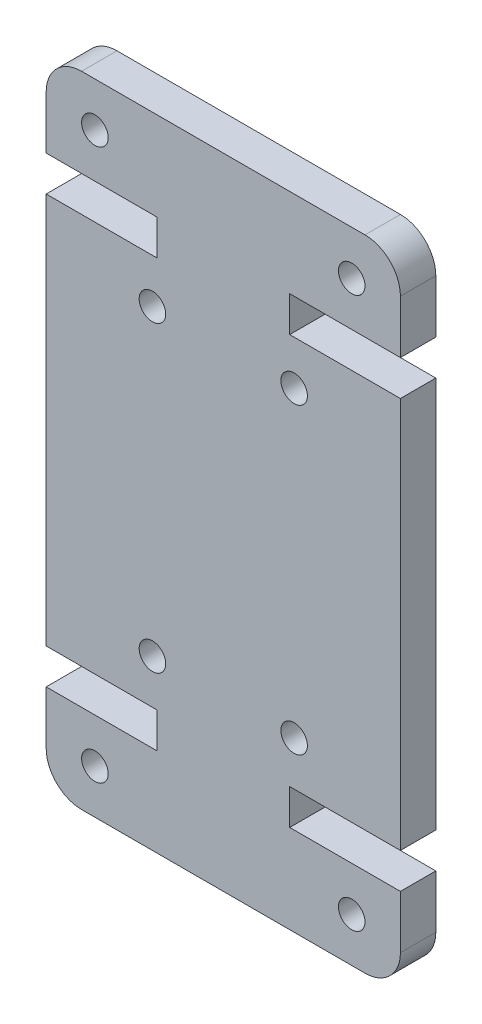
ISO-10303-21;
HEADER;
FILE_DESCRIPTION(('STEP AP214'),'2;1');
FILE_NAME('part.step','',(''),(''),'','','');
FILE_SCHEMA(('AUTOMOTIVE_DESIGN { 1 0 10303 214 1 1 1 1 }'));
ENDSEC;
DATA;
#1=APPLICATION_CONTEXT('core data for automotive mechanical design processes');
#2=APPLICATION_PROTOCOL_DEFINITION('international standard','automotive_design',2000,#1);
#3=PRODUCT_CONTEXT('',#1,'mechanical');
#4=PRODUCT('Part','Part','',(#3));
#5=PRODUCT_RELATED_PRODUCT_CATEGORY('part','',(#4));
#6=PRODUCT_DEFINITION_FORMATION('','',#4);
#7=PRODUCT_DEFINITION_CONTEXT('part definition',#1,'design');
#8=PRODUCT_DEFINITION('design','',#6,#7);
#9=PRODUCT_DEFINITION_SHAPE('','',#8);
#10=(LENGTH_UNIT() NAMED_UNIT(*) SI_UNIT(.MILLI.,.METRE.));
#11=(NAMED_UNIT(*) PLANE_ANGLE_UNIT() SI_UNIT($,.RADIAN.));
#12=(NAMED_UNIT(*) SI_UNIT($,.STERADIAN.) SOLID_ANGLE_UNIT());
#13=UNCERTAINTY_MEASURE_WITH_UNIT(LENGTH_MEASURE(1.E-05),#10,'distance_accuracy_value','');
#14=(GEOMETRIC_REPRESENTATION_CONTEXT(3) GLOBAL_UNCERTAINTY_ASSIGNED_CONTEXT((#13)) GLOBAL_UNIT_ASSIGNED_CONTEXT((#10,
#11,#12)) REPRESENTATION_CONTEXT('',''));
#15=CARTESIAN_POINT('',(0.,0.,0.));
#16=DIRECTION('',(0.,0.,1.));
#17=DIRECTION('',(1.,0.,0.));
#18=AXIS2_PLACEMENT_3D('',#15,#16,#17);
#19=CARTESIAN_POINT('',(17.9999999999993,34.0999999999998,2.));
#20=DIRECTION('',(0.,0.,1.));
#21=DIRECTION('',(1.,0.,0.));
#22=AXIS2_PLACEMENT_3D('',#19,#20,#21);
#23=PLANE('',#22);
#24=CARTESIAN_POINT('',(17.25,33.5999999999996,2.));
#25=DIRECTION('',(0.,0.,1.));
#26=DIRECTION('',(1.,0.,0.));
#27=AXIS2_PLACEMENT_3D('',#24,#25,#26);
#28=CIRCLE('',#27,0.750000000000027);
#29=CARTESIAN_POINT('',(18.,33.5999999999996,2.));
#30=VERTEX_POINT('',#29);
#31=EDGE_CURVE('E464',#30,#30,#28,.T.);
#32=ORIENTED_EDGE('',*,*,#31,.F.);
#33=EDGE_LOOP('',(#32));
#34=FACE_BOUND('',#33,.T.);
#35=CARTESIAN_POINT('',(17.25,2.49999999999995,2.));
#36=DIRECTION('',(0.,0.,1.));
#37=DIRECTION('',(1.,0.,0.));
#38=AXIS2_PLACEMENT_3D('',#35,#36,#37);
#39=CIRCLE('',#38,0.750000000000028);
#40=CARTESIAN_POINT('',(18.,2.49999999999995,2.));
#41=VERTEX_POINT('',#40);
#42=EDGE_CURVE('E476',#41,#41,#39,.T.);
#43=ORIENTED_EDGE('',*,*,#42,.F.);
#44=EDGE_LOOP('',(#43));
#45=FACE_BOUND('',#44,.T.);
#46=CARTESIAN_POINT('',(14.,9.49999999999962,2.));
#47=DIRECTION('',(0.,0.,1.));
#48=DIRECTION('',(1.,0.,0.));
#49=AXIS2_PLACEMENT_3D('',#46,#47,#48);
#50=CIRCLE('',#49,0.750000000000029);
#51=CARTESIAN_POINT('',(14.75,9.49999999999962,2.));
#52=VERTEX_POINT('',#51);
#53=EDGE_CURVE('E488',#52,#52,#50,.T.);
#54=ORIENTED_EDGE('',*,*,#53,.F.);
#55=EDGE_LOOP('',(#54));
#56=FACE_BOUND('',#55,.T.);
#57=CARTESIAN_POINT('',(14.,26.6,2.));
#58=DIRECTION('',(0.,0.,1.));
#59=DIRECTION('',(1.,0.,0.));
#60=AXIS2_PLACEMENT_3D('',#57,#58,#59);
#61=CIRCLE('',#60,0.750000000000029);
#62=CARTESIAN_POINT('',(14.75,26.6,2.));
#63=VERTEX_POINT('',#62);
#64=EDGE_CURVE('E230',#63,#63,#61,.T.);
#65=ORIENTED_EDGE('',*,*,#64,.F.);
#66=EDGE_LOOP('',(#65));
#67=FACE_BOUND('',#66,.T.);
#68=CARTESIAN_POINT('',(17.9999999999993,34.0999999999998,2.));
#69=DIRECTION('',(0.,0.,1.));
#70=DIRECTION('',(1.,0.,0.));
#71=AXIS2_PLACEMENT_3D('',#68,#69,#70);
#72=CIRCLE('',#71,2.);
#73=CARTESIAN_POINT('',(19.9999999999993,34.0999999999998,2.));
#74=VERTEX_POINT('',#73);
#75=CARTESIAN_POINT('',(17.9999999999993,36.0999999999998,2.));
#76=VERTEX_POINT('',#75);
#77=EDGE_CURVE('E273',#74,#76,#72,.T.);
#78=ORIENTED_EDGE('',*,*,#77,.T.);
#79=DIRECTION('',(-1.,0.,0.));
#80=VECTOR('',#79,1.);
#81=CARTESIAN_POINT('',(2.,36.0999999999998,2.));
#82=LINE('',#81,#80);
#83=CARTESIAN_POINT('',(2.,36.0999999999998,2.));
#84=VERTEX_POINT('',#83);
#85=EDGE_CURVE('E141',#76,#84,#82,.T.);
#86=ORIENTED_EDGE('',*,*,#85,.T.);
#87=CARTESIAN_POINT('',(2.,34.0999999999998,2.));
#88=DIRECTION('',(0.,0.,1.));
#89=DIRECTION('',(1.,0.,0.));
#90=AXIS2_PLACEMENT_3D('',#87,#88,#89);
#91=CIRCLE('',#90,2.);
#92=CARTESIAN_POINT('',(0.,34.0999999999998,2.));
#93=VERTEX_POINT('',#92);
#94=EDGE_CURVE('E336',#84,#93,#91,.T.);
#95=ORIENTED_EDGE('',*,*,#94,.T.);
#96=DIRECTION('',(0.,-1.,0.));
#97=VECTOR('',#96,1.);
#98=CARTESIAN_POINT('',(0.,34.0999999999998,2.));
#99=LINE('',#98,#97);
#100=CARTESIAN_POINT('',(0.,31.1000000000003,2.));
#101=VERTEX_POINT('',#100);
#102=EDGE_CURVE('E355',#93,#101,#99,.T.);
#103=ORIENTED_EDGE('',*,*,#102,.T.);
#104=DIRECTION('',(1.,0.,0.));
#105=VECTOR('',#104,1.);
#106=CARTESIAN_POINT('',(6.24999999999987,31.1000000000003,2.));
#107=LINE('',#106,#105);
#108=CARTESIAN_POINT('',(6.24999999999987,31.1000000000003,2.));
#109=VERTEX_POINT('',#108);
#110=EDGE_CURVE('E352',#101,#109,#107,.T.);
#111=ORIENTED_EDGE('',*,*,#110,.T.);
#112=DIRECTION('',(0.,-1.,0.));
#113=VECTOR('',#112,1.);
#114=CARTESIAN_POINT('',(6.24999999999987,31.1000000000003,2.));
#115=LINE('',#114,#113);
#116=CARTESIAN_POINT('',(6.24999999999987,29.1000000000001,2.));
#117=VERTEX_POINT('',#116);
#118=EDGE_CURVE('E354',#109,#117,#115,.T.);
#119=ORIENTED_EDGE('',*,*,#118,.T.);
#120=DIRECTION('',(-1.,0.,0.));
#121=VECTOR('',#120,1.);
#122=CARTESIAN_POINT('',(6.24999999999987,29.1000000000001,2.));
#123=LINE('',#122,#121);
#124=CARTESIAN_POINT('',(0.,29.1000000000001,2.));
#125=VERTEX_POINT('',#124);
#126=EDGE_CURVE('E357',#117,#125,#123,.T.);
#127=ORIENTED_EDGE('',*,*,#126,.T.);
#128=DIRECTION('',(0.,-1.,0.));
#129=VECTOR('',#128,1.);
#130=CARTESIAN_POINT('',(0.,29.1000000000001,2.));
#131=LINE('',#130,#129);
#132=CARTESIAN_POINT('',(0.,6.99999999999967,2.));
#133=VERTEX_POINT('',#132);
#134=EDGE_CURVE('E363',#125,#133,#131,.T.);
#135=ORIENTED_EDGE('',*,*,#134,.T.);
#136=DIRECTION('',(1.,0.,0.));
#137=VECTOR('',#136,1.);
#138=CARTESIAN_POINT('',(6.24999999999987,6.99999999999967,2.));
#139=LINE('',#138,#137);
#140=CARTESIAN_POINT('',(6.24999999999987,6.99999999999967,2.));
#141=VERTEX_POINT('',#140);
#142=EDGE_CURVE('E365',#133,#141,#139,.T.);
#143=ORIENTED_EDGE('',*,*,#142,.T.);
#144=DIRECTION('',(0.,-1.,0.));
#145=VECTOR('',#144,1.);
#146=CARTESIAN_POINT('',(6.24999999999987,4.99999999999945,2.));
#147=LINE('',#146,#145);
#148=CARTESIAN_POINT('',(6.24999999999987,4.99999999999945,2.));
#149=VERTEX_POINT('',#148);
#150=EDGE_CURVE('E367',#141,#149,#147,.T.);
#151=ORIENTED_EDGE('',*,*,#150,.T.);
#152=DIRECTION('',(-1.,0.,0.));
#153=VECTOR('',#152,1.);
#154=CARTESIAN_POINT('',(6.24999999999987,4.99999999999945,2.));
#155=LINE('',#154,#153);
#156=CARTESIAN_POINT('',(0.,4.99999999999945,2.));
#157=VERTEX_POINT('',#156);
#158=EDGE_CURVE('E369',#149,#157,#155,.T.);
#159=ORIENTED_EDGE('',*,*,#158,.T.);
#160=DIRECTION('',(0.,-1.,0.));
#161=VECTOR('',#160,1.);
#162=CARTESIAN_POINT('',(0.,2.,2.));
#163=LINE('',#162,#161);
#164=CARTESIAN_POINT('',(0.,2.,2.));
#165=VERTEX_POINT('',#164);
#166=EDGE_CURVE('E371',#157,#165,#163,.T.);
#167=ORIENTED_EDGE('',*,*,#166,.T.);
#168=CARTESIAN_POINT('',(2.00000000000001,2.,2.));
#169=DIRECTION('',(0.,0.,1.));
#170=DIRECTION('',(1.,0.,0.));
#171=AXIS2_PLACEMENT_3D('',#168,#169,#170);
#172=CIRCLE('',#171,2.);
#173=CARTESIAN_POINT('',(2.00000000000001,0.,2.));
#174=VERTEX_POINT('',#173);
#175=EDGE_CURVE('E373',#165,#174,#172,.T.);
#176=ORIENTED_EDGE('',*,*,#175,.T.);
#177=DIRECTION('',(1.,0.,0.));
#178=VECTOR('',#177,1.);
#179=CARTESIAN_POINT('',(2.00000000000001,0.,2.));
#180=LINE('',#179,#178);
#181=CARTESIAN_POINT('',(17.9999999999994,0.,2.));
#182=VERTEX_POINT('',#181);
#183=EDGE_CURVE('E375',#174,#182,#180,.T.);
#184=ORIENTED_EDGE('',*,*,#183,.T.);
#185=CARTESIAN_POINT('',(17.9999999999994,2.,2.));
#186=DIRECTION('',(0.,0.,1.));
#187=DIRECTION('',(1.,0.,0.));
#188=AXIS2_PLACEMENT_3D('',#185,#186,#187);
#189=CIRCLE('',#188,2.);
#190=CARTESIAN_POINT('',(19.9999999999994,2.,2.));
#191=VERTEX_POINT('',#190);
#192=EDGE_CURVE('E377',#182,#191,#189,.T.);
#193=ORIENTED_EDGE('',*,*,#192,.T.);
#194=DIRECTION('',(0.,1.,0.));
#195=VECTOR('',#194,1.);
#196=CARTESIAN_POINT('',(19.9999999999994,4.99999999999945,2.));
#197=LINE('',#196,#195);
#198=CARTESIAN_POINT('',(19.9999999999994,4.99999999999945,2.));
#199=VERTEX_POINT('',#198);
#200=EDGE_CURVE('E379',#191,#199,#197,.T.);
#201=ORIENTED_EDGE('',*,*,#200,.T.);
#202=DIRECTION('',(-1.,0.,0.));
#203=VECTOR('',#202,1.);
#204=CARTESIAN_POINT('',(13.7499999999993,4.99999999999945,2.));
#205=LINE('',#204,#203);
#206=CARTESIAN_POINT('',(13.7499999999993,4.99999999999945,2.));
#207=VERTEX_POINT('',#206);
#208=EDGE_CURVE('E381',#199,#207,#205,.T.);
#209=ORIENTED_EDGE('',*,*,#208,.T.);
#210=DIRECTION('',(0.,1.,0.));
#211=VECTOR('',#210,1.);
#212=CARTESIAN_POINT('',(13.7499999999993,4.99999999999945,2.));
#213=LINE('',#212,#211);
#214=CARTESIAN_POINT('',(13.7499999999993,6.99999999999967,2.));
#215=VERTEX_POINT('',#214);
#216=EDGE_CURVE('E383',#207,#215,#213,.T.);
#217=ORIENTED_EDGE('',*,*,#216,.T.);
#218=DIRECTION('',(1.,0.,0.));
#219=VECTOR('',#218,1.);
#220=CARTESIAN_POINT('',(13.7499999999993,6.99999999999967,2.));
#221=LINE('',#220,#219);
#222=CARTESIAN_POINT('',(19.9999999999994,6.99999999999967,2.));
#223=VERTEX_POINT('',#222);
#224=EDGE_CURVE('E385',#215,#223,#221,.T.);
#225=ORIENTED_EDGE('',*,*,#224,.T.);
#226=DIRECTION('',(0.,1.,0.));
#227=VECTOR('',#226,1.);
#228=CARTESIAN_POINT('',(19.9999999999994,29.1000000000001,2.));
#229=LINE('',#228,#227);
#230=CARTESIAN_POINT('',(19.9999999999994,29.1000000000001,2.));
#231=VERTEX_POINT('',#230);
#232=EDGE_CURVE('E387',#223,#231,#229,.T.);
#233=ORIENTED_EDGE('',*,*,#232,.T.);
#234=DIRECTION('',(-1.,0.,0.));
#235=VECTOR('',#234,1.);
#236=CARTESIAN_POINT('',(13.7499999999993,29.1000000000001,2.));
#237=LINE('',#236,#235);
#238=CARTESIAN_POINT('',(13.7499999999993,29.1000000000001,2.));
#239=VERTEX_POINT('',#238);
#240=EDGE_CURVE('E208',#231,#239,#237,.T.);
#241=ORIENTED_EDGE('',*,*,#240,.T.);
#242=DIRECTION('',(0.,1.,0.));
#243=VECTOR('',#242,1.);
#244=CARTESIAN_POINT('',(13.7499999999993,31.1000000000003,2.));
#245=LINE('',#244,#243);
#246=CARTESIAN_POINT('',(13.7499999999993,31.1000000000003,2.));
#247=VERTEX_POINT('',#246);
#248=EDGE_CURVE('E202',#239,#247,#245,.T.);
#249=ORIENTED_EDGE('',*,*,#248,.T.);
#250=DIRECTION('',(1.,0.,0.));
#251=VECTOR('',#250,1.);
#252=CARTESIAN_POINT('',(13.7499999999993,31.1000000000003,2.));
#253=LINE('',#252,#251);
#254=CARTESIAN_POINT('',(19.9999999999994,31.1000000000003,2.));
#255=VERTEX_POINT('',#254);
#256=EDGE_CURVE('E206',#247,#255,#253,.T.);
#257=ORIENTED_EDGE('',*,*,#256,.T.);
#258=DIRECTION('',(0.,1.,0.));
#259=VECTOR('',#258,1.);
#260=CARTESIAN_POINT('',(19.9999999999994,31.1000000000003,2.));
#261=LINE('',#260,#259);
#262=EDGE_CURVE('E50',#255,#74,#261,.T.);
#263=ORIENTED_EDGE('',*,*,#262,.T.);
#264=EDGE_LOOP('',(#78,#86,#95,#103,#111,#119,#127,#135,#143,#151,#159,#167,#176,#184,#193,#201,
#209,#217,#225,#233,#241,#249,#257,#263));
#265=FACE_BOUND('',#264,.T.);
#266=CARTESIAN_POINT('',(6.00000000000001,26.6,2.));
#267=DIRECTION('',(0.,0.,1.));
#268=DIRECTION('',(1.,0.,0.));
#269=AXIS2_PLACEMENT_3D('',#266,#267,#268);
#270=CIRCLE('',#269,0.750000000000028);
#271=CARTESIAN_POINT('',(6.75000000000003,26.6,2.));
#272=VERTEX_POINT('',#271);
#273=EDGE_CURVE('E494',#272,#272,#270,.T.);
#274=ORIENTED_EDGE('',*,*,#273,.F.);
#275=EDGE_LOOP('',(#274));
#276=FACE_BOUND('',#275,.T.);
#277=CARTESIAN_POINT('',(6.00000000000001,9.49999999999962,2.));
#278=DIRECTION('',(0.,0.,1.));
#279=DIRECTION('',(1.,0.,0.));
#280=AXIS2_PLACEMENT_3D('',#277,#278,#279);
#281=CIRCLE('',#280,0.750000000000028);
#282=CARTESIAN_POINT('',(6.75000000000003,9.49999999999962,2.));
#283=VERTEX_POINT('',#282);
#284=EDGE_CURVE('E482',#283,#283,#281,.T.);
#285=ORIENTED_EDGE('',*,*,#284,.F.);
#286=EDGE_LOOP('',(#285));
#287=FACE_BOUND('',#286,.T.);
#288=CARTESIAN_POINT('',(2.74999999999981,2.50000000000017,2.));
#289=DIRECTION('',(0.,0.,1.));
#290=DIRECTION('',(1.,0.,0.));
#291=AXIS2_PLACEMENT_3D('',#288,#289,#290);
#292=CIRCLE('',#291,0.750000000000028);
#293=CARTESIAN_POINT('',(3.49999999999984,2.50000000000017,2.));
#294=VERTEX_POINT('',#293);
#295=EDGE_CURVE('E470',#294,#294,#292,.T.);
#296=ORIENTED_EDGE('',*,*,#295,.F.);
#297=EDGE_LOOP('',(#296));
#298=FACE_BOUND('',#297,.T.);
#299=CARTESIAN_POINT('',(2.74999999999981,33.5999999999999,2.));
#300=DIRECTION('',(0.,0.,1.));
#301=DIRECTION('',(1.,0.,0.));
#302=AXIS2_PLACEMENT_3D('',#299,#300,#301);
#303=CIRCLE('',#302,0.750000000000028);
#304=CARTESIAN_POINT('',(3.49999999999984,33.5999999999999,2.));
#305=VERTEX_POINT('',#304);
#306=EDGE_CURVE('E455',#305,#305,#303,.T.);
#307=ORIENTED_EDGE('',*,*,#306,.F.);
#308=EDGE_LOOP('',(#307));
#309=FACE_BOUND('',#308,.T.);
#310=ADVANCED_FACE('F33',(#34,#45,#56,#67,#265,#276,#287,#298,#309),#23,.T.);
#311=CARTESIAN_POINT('',(17.9999999999993,34.0999999999998,0.));
#312=DIRECTION('',(0.,0.,1.));
#313=DIRECTION('',(1.,0.,0.));
#314=AXIS2_PLACEMENT_3D('',#311,#312,#313);
#315=PLANE('',#314);
#316=CARTESIAN_POINT('',(17.25,33.5999999999996,0.));
#317=DIRECTION('',(0.,0.,1.));
#318=DIRECTION('',(1.,0.,0.));
#319=AXIS2_PLACEMENT_3D('',#316,#317,#318);
#320=CIRCLE('',#319,0.750000000000027);
#321=CARTESIAN_POINT('',(18.,33.5999999999996,0.));
#322=VERTEX_POINT('',#321);
#323=EDGE_CURVE('E461',#322,#322,#320,.T.);
#324=ORIENTED_EDGE('',*,*,#323,.T.);
#325=EDGE_LOOP('',(#324));
#326=FACE_BOUND('',#325,.T.);
#327=CARTESIAN_POINT('',(17.25,2.49999999999995,0.));
#328=DIRECTION('',(0.,0.,1.));
#329=DIRECTION('',(1.,0.,0.));
#330=AXIS2_PLACEMENT_3D('',#327,#328,#329);
#331=CIRCLE('',#330,0.750000000000028);
#332=CARTESIAN_POINT('',(18.,2.49999999999995,0.));
#333=VERTEX_POINT('',#332);
#334=EDGE_CURVE('E473',#333,#333,#331,.T.);
#335=ORIENTED_EDGE('',*,*,#334,.T.);
#336=EDGE_LOOP('',(#335));
#337=FACE_BOUND('',#336,.T.);
#338=CARTESIAN_POINT('',(14.,9.49999999999962,0.));
#339=DIRECTION('',(0.,0.,1.));
#340=DIRECTION('',(1.,0.,0.));
#341=AXIS2_PLACEMENT_3D('',#338,#339,#340);
#342=CIRCLE('',#341,0.750000000000029);
#343=CARTESIAN_POINT('',(14.75,9.49999999999962,0.));
#344=VERTEX_POINT('',#343);
#345=EDGE_CURVE('E485',#344,#344,#342,.T.);
#346=ORIENTED_EDGE('',*,*,#345,.T.);
#347=EDGE_LOOP('',(#346));
#348=FACE_BOUND('',#347,.T.);
#349=CARTESIAN_POINT('',(14.,26.6,0.));
#350=DIRECTION('',(0.,0.,1.));
#351=DIRECTION('',(1.,0.,0.));
#352=AXIS2_PLACEMENT_3D('',#349,#350,#351);
#353=CIRCLE('',#352,0.750000000000029);
#354=CARTESIAN_POINT('',(14.75,26.6,0.));
#355=VERTEX_POINT('',#354);
#356=EDGE_CURVE('E497',#355,#355,#353,.T.);
#357=ORIENTED_EDGE('',*,*,#356,.T.);
#358=EDGE_LOOP('',(#357));
#359=FACE_BOUND('',#358,.T.);
#360=CARTESIAN_POINT('',(17.9999999999993,34.0999999999998,0.));
#361=DIRECTION('',(0.,0.,1.));
#362=DIRECTION('',(1.,0.,0.));
#363=AXIS2_PLACEMENT_3D('',#360,#361,#362);
#364=CIRCLE('',#363,2.);
#365=CARTESIAN_POINT('',(19.9999999999993,34.0999999999998,0.));
#366=VERTEX_POINT('',#365);
#367=CARTESIAN_POINT('',(17.9999999999993,36.0999999999998,0.));
#368=VERTEX_POINT('',#367);
#369=EDGE_CURVE('E226',#366,#368,#364,.T.);
#370=ORIENTED_EDGE('',*,*,#369,.F.);
#371=DIRECTION('',(0.,1.,0.));
#372=VECTOR('',#371,1.);
#373=CARTESIAN_POINT('',(19.9999999999994,31.1000000000003,0.));
#374=LINE('',#373,#372);
#375=CARTESIAN_POINT('',(19.9999999999994,31.1000000000003,0.));
#376=VERTEX_POINT('',#375);
#377=EDGE_CURVE('E133',#376,#366,#374,.T.);
#378=ORIENTED_EDGE('',*,*,#377,.F.);
#379=DIRECTION('',(1.,0.,0.));
#380=VECTOR('',#379,1.);
#381=CARTESIAN_POINT('',(13.7499999999993,31.1000000000003,0.));
#382=LINE('',#381,#380);
#383=CARTESIAN_POINT('',(13.7499999999993,31.1000000000003,0.));
#384=VERTEX_POINT('',#383);
#385=EDGE_CURVE('E127',#384,#376,#382,.T.);
#386=ORIENTED_EDGE('',*,*,#385,.F.);
#387=DIRECTION('',(0.,1.,0.));
#388=VECTOR('',#387,1.);
#389=CARTESIAN_POINT('',(13.7499999999993,31.1000000000003,0.));
#390=LINE('',#389,#388);
#391=CARTESIAN_POINT('',(13.7499999999993,29.1000000000001,0.));
#392=VERTEX_POINT('',#391);
#393=EDGE_CURVE('E216',#392,#384,#390,.T.);
#394=ORIENTED_EDGE('',*,*,#393,.F.);
#395=DIRECTION('',(-1.,0.,0.));
#396=VECTOR('',#395,1.);
#397=CARTESIAN_POINT('',(13.7499999999993,29.1000000000001,0.));
#398=LINE('',#397,#396);
#399=CARTESIAN_POINT('',(19.9999999999994,29.1000000000001,0.));
#400=VERTEX_POINT('',#399);
#401=EDGE_CURVE('E268',#400,#392,#398,.T.);
#402=ORIENTED_EDGE('',*,*,#401,.F.);
#403=DIRECTION('',(0.,1.,0.));
#404=VECTOR('',#403,1.);
#405=CARTESIAN_POINT('',(19.9999999999994,29.1000000000001,0.));
#406=LINE('',#405,#404);
#407=CARTESIAN_POINT('',(19.9999999999994,6.99999999999967,0.));
#408=VERTEX_POINT('',#407);
#409=EDGE_CURVE('E266',#408,#400,#406,.T.);
#410=ORIENTED_EDGE('',*,*,#409,.F.);
#411=DIRECTION('',(1.,0.,0.));
#412=VECTOR('',#411,1.);
#413=CARTESIAN_POINT('',(13.7499999999993,6.99999999999967,0.));
#414=LINE('',#413,#412);
#415=CARTESIAN_POINT('',(13.7499999999993,6.99999999999967,0.));
#416=VERTEX_POINT('',#415);
#417=EDGE_CURVE('E264',#416,#408,#414,.T.);
#418=ORIENTED_EDGE('',*,*,#417,.F.);
#419=DIRECTION('',(0.,1.,0.));
#420=VECTOR('',#419,1.);
#421=CARTESIAN_POINT('',(13.7499999999993,4.99999999999945,0.));
#422=LINE('',#421,#420);
#423=CARTESIAN_POINT('',(13.7499999999993,4.99999999999945,0.));
#424=VERTEX_POINT('',#423);
#425=EDGE_CURVE('E262',#424,#416,#422,.T.);
#426=ORIENTED_EDGE('',*,*,#425,.F.);
#427=DIRECTION('',(-1.,0.,0.));
#428=VECTOR('',#427,1.);
#429=CARTESIAN_POINT('',(13.7499999999993,4.99999999999945,0.));
#430=LINE('',#429,#428);
#431=CARTESIAN_POINT('',(19.9999999999994,4.99999999999945,0.));
#432=VERTEX_POINT('',#431);
#433=EDGE_CURVE('E260',#432,#424,#430,.T.);
#434=ORIENTED_EDGE('',*,*,#433,.F.);
#435=DIRECTION('',(0.,1.,0.));
#436=VECTOR('',#435,1.);
#437=CARTESIAN_POINT('',(19.9999999999994,4.99999999999945,0.));
#438=LINE('',#437,#436);
#439=CARTESIAN_POINT('',(19.9999999999994,2.,0.));
#440=VERTEX_POINT('',#439);
#441=EDGE_CURVE('E258',#440,#432,#438,.T.);
#442=ORIENTED_EDGE('',*,*,#441,.F.);
#443=CARTESIAN_POINT('',(17.9999999999994,2.,0.));
#444=DIRECTION('',(0.,0.,1.));
#445=DIRECTION('',(1.,0.,0.));
#446=AXIS2_PLACEMENT_3D('',#443,#444,#445);
#447=CIRCLE('',#446,2.);
#448=CARTESIAN_POINT('',(17.9999999999994,0.,0.));
#449=VERTEX_POINT('',#448);
#450=EDGE_CURVE('E256',#449,#440,#447,.T.);
#451=ORIENTED_EDGE('',*,*,#450,.F.);
#452=DIRECTION('',(1.,0.,0.));
#453=VECTOR('',#452,1.);
#454=CARTESIAN_POINT('',(2.00000000000001,0.,0.));
#455=LINE('',#454,#453);
#456=CARTESIAN_POINT('',(2.00000000000001,0.,0.));
#457=VERTEX_POINT('',#456);
#458=EDGE_CURVE('E254',#457,#449,#455,.T.);
#459=ORIENTED_EDGE('',*,*,#458,.F.);
#460=CARTESIAN_POINT('',(2.00000000000001,2.,0.));
#461=DIRECTION('',(0.,0.,1.));
#462=DIRECTION('',(1.,0.,0.));
#463=AXIS2_PLACEMENT_3D('',#460,#461,#462);
#464=CIRCLE('',#463,2.);
#465=CARTESIAN_POINT('',(0.,2.,0.));
#466=VERTEX_POINT('',#465);
#467=EDGE_CURVE('E252',#466,#457,#464,.T.);
#468=ORIENTED_EDGE('',*,*,#467,.F.);
#469=DIRECTION('',(0.,-1.,0.));
#470=VECTOR('',#469,1.);
#471=CARTESIAN_POINT('',(0.,2.,0.));
#472=LINE('',#471,#470);
#473=CARTESIAN_POINT('',(0.,4.99999999999945,0.));
#474=VERTEX_POINT('',#473);
#475=EDGE_CURVE('E250',#474,#466,#472,.T.);
#476=ORIENTED_EDGE('',*,*,#475,.F.);
#477=DIRECTION('',(-1.,0.,0.));
#478=VECTOR('',#477,1.);
#479=CARTESIAN_POINT('',(6.24999999999987,4.99999999999945,0.));
#480=LINE('',#479,#478);
#481=CARTESIAN_POINT('',(6.24999999999987,4.99999999999945,0.));
#482=VERTEX_POINT('',#481);
#483=EDGE_CURVE('E248',#482,#474,#480,.T.);
#484=ORIENTED_EDGE('',*,*,#483,.F.);
#485=DIRECTION('',(0.,-1.,0.));
#486=VECTOR('',#485,1.);
#487=CARTESIAN_POINT('',(6.24999999999987,4.99999999999945,0.));
#488=LINE('',#487,#486);
#489=CARTESIAN_POINT('',(6.24999999999987,6.99999999999967,0.));
#490=VERTEX_POINT('',#489);
#491=EDGE_CURVE('E246',#490,#482,#488,.T.);
#492=ORIENTED_EDGE('',*,*,#491,.F.);
#493=DIRECTION('',(1.,0.,0.));
#494=VECTOR('',#493,1.);
#495=CARTESIAN_POINT('',(6.24999999999987,6.99999999999967,0.));
#496=LINE('',#495,#494);
#497=CARTESIAN_POINT('',(0.,6.99999999999967,0.));
#498=VERTEX_POINT('',#497);
#499=EDGE_CURVE('E244',#498,#490,#496,.T.);
#500=ORIENTED_EDGE('',*,*,#499,.F.);
#501=DIRECTION('',(0.,-1.,0.));
#502=VECTOR('',#501,1.);
#503=CARTESIAN_POINT('',(0.,29.1000000000001,0.));
#504=LINE('',#503,#502);
#505=CARTESIAN_POINT('',(0.,29.1000000000001,0.));
#506=VERTEX_POINT('',#505);
#507=EDGE_CURVE('E242',#506,#498,#504,.T.);
#508=ORIENTED_EDGE('',*,*,#507,.F.);
#509=DIRECTION('',(-1.,0.,0.));
#510=VECTOR('',#509,1.);
#511=CARTESIAN_POINT('',(6.24999999999987,29.1000000000001,0.));
#512=LINE('',#511,#510);
#513=CARTESIAN_POINT('',(6.24999999999987,29.1000000000001,0.));
#514=VERTEX_POINT('',#513);
#515=EDGE_CURVE('E240',#514,#506,#512,.T.);
#516=ORIENTED_EDGE('',*,*,#515,.F.);
#517=DIRECTION('',(0.,-1.,0.));
#518=VECTOR('',#517,1.);
#519=CARTESIAN_POINT('',(6.24999999999987,31.1000000000003,0.));
#520=LINE('',#519,#518);
#521=CARTESIAN_POINT('',(6.24999999999987,31.1000000000003,0.));
#522=VERTEX_POINT('',#521);
#523=EDGE_CURVE('E238',#522,#514,#520,.T.);
#524=ORIENTED_EDGE('',*,*,#523,.F.);
#525=DIRECTION('',(1.,0.,0.));
#526=VECTOR('',#525,1.);
#527=CARTESIAN_POINT('',(6.24999999999987,31.1000000000003,0.));
#528=LINE('',#527,#526);
#529=CARTESIAN_POINT('',(0.,31.1000000000003,0.));
#530=VERTEX_POINT('',#529);
#531=EDGE_CURVE('E236',#530,#522,#528,.T.);
#532=ORIENTED_EDGE('',*,*,#531,.F.);
#533=DIRECTION('',(0.,-1.,0.));
#534=VECTOR('',#533,1.);
#535=CARTESIAN_POINT('',(0.,34.0999999999998,0.));
#536=LINE('',#535,#534);
#537=CARTESIAN_POINT('',(0.,34.0999999999998,0.));
#538=VERTEX_POINT('',#537);
#539=EDGE_CURVE('E234',#538,#530,#536,.T.);
#540=ORIENTED_EDGE('',*,*,#539,.F.);
#541=CARTESIAN_POINT('',(2.,34.0999999999998,0.));
#542=DIRECTION('',(0.,0.,1.));
#543=DIRECTION('',(1.,0.,0.));
#544=AXIS2_PLACEMENT_3D('',#541,#542,#543);
#545=CIRCLE('',#544,2.);
#546=CARTESIAN_POINT('',(2.,36.0999999999998,0.));
#547=VERTEX_POINT('',#546);
#548=EDGE_CURVE('E232',#547,#538,#545,.T.);
#549=ORIENTED_EDGE('',*,*,#548,.F.);
#550=DIRECTION('',(-1.,0.,0.));
#551=VECTOR('',#550,1.);
#552=CARTESIAN_POINT('',(2.,36.0999999999998,0.));
#553=LINE('',#552,#551);
#554=EDGE_CURVE('E229',#368,#547,#553,.T.);
#555=ORIENTED_EDGE('',*,*,#554,.F.);
#556=EDGE_LOOP('',(#370,#378,#386,#394,#402,#410,#418,#426,#434,#442,#451,#459,#468,#476,#484,
#492,#500,#508,#516,#524,#532,#540,#549,#555));
#557=FACE_BOUND('',#556,.T.);
#558=CARTESIAN_POINT('',(6.00000000000001,26.6,0.));
#559=DIRECTION('',(0.,0.,1.));
#560=DIRECTION('',(1.,0.,0.));
#561=AXIS2_PLACEMENT_3D('',#558,#559,#560);
#562=CIRCLE('',#561,0.750000000000028);
#563=CARTESIAN_POINT('',(6.75000000000003,26.6,0.));
#564=VERTEX_POINT('',#563);
#565=EDGE_CURVE('E491',#564,#564,#562,.T.);
#566=ORIENTED_EDGE('',*,*,#565,.T.);
#567=EDGE_LOOP('',(#566));
#568=FACE_BOUND('',#567,.T.);
#569=CARTESIAN_POINT('',(6.00000000000001,9.49999999999962,0.));
#570=DIRECTION('',(0.,0.,1.));
#571=DIRECTION('',(1.,0.,0.));
#572=AXIS2_PLACEMENT_3D('',#569,#570,#571);
#573=CIRCLE('',#572,0.750000000000028);
#574=CARTESIAN_POINT('',(6.75000000000003,9.49999999999962,0.));
#575=VERTEX_POINT('',#574);
#576=EDGE_CURVE('E479',#575,#575,#573,.T.);
#577=ORIENTED_EDGE('',*,*,#576,.T.);
#578=EDGE_LOOP('',(#577));
#579=FACE_BOUND('',#578,.T.);
#580=CARTESIAN_POINT('',(2.74999999999981,2.50000000000017,0.));
#581=DIRECTION('',(0.,0.,1.));
#582=DIRECTION('',(1.,0.,0.));
#583=AXIS2_PLACEMENT_3D('',#580,#581,#582);
#584=CIRCLE('',#583,0.750000000000028);
#585=CARTESIAN_POINT('',(3.49999999999984,2.50000000000017,0.));
#586=VERTEX_POINT('',#585);
#587=EDGE_CURVE('E467',#586,#586,#584,.T.);
#588=ORIENTED_EDGE('',*,*,#587,.T.);
#589=EDGE_LOOP('',(#588));
#590=FACE_BOUND('',#589,.T.);
#591=CARTESIAN_POINT('',(2.74999999999981,33.5999999999999,0.));
#592=DIRECTION('',(0.,0.,1.));
#593=DIRECTION('',(1.,0.,0.));
#594=AXIS2_PLACEMENT_3D('',#591,#592,#593);
#595=CIRCLE('',#594,0.750000000000028);
#596=CARTESIAN_POINT('',(3.49999999999984,33.5999999999999,0.));
#597=VERTEX_POINT('',#596);
#598=EDGE_CURVE('E458',#597,#597,#595,.T.);
#599=ORIENTED_EDGE('',*,*,#598,.T.);
#600=EDGE_LOOP('',(#599));
#601=FACE_BOUND('',#600,.T.);
#602=ADVANCED_FACE('F340',(#326,#337,#348,#359,#557,#568,#579,#590,#601),#315,.F.);
#603=CARTESIAN_POINT('',(17.9999999999993,34.0999999999998,2.));
#604=DIRECTION('',(0.,0.,-1.));
#605=DIRECTION('',(-1.,0.,0.));
#606=AXIS2_PLACEMENT_3D('',#603,#604,#605);
#607=CYLINDRICAL_SURFACE('',#606,2.);
#608=ORIENTED_EDGE('',*,*,#369,.T.);
#609=DIRECTION('',(0.,0.,-1.));
#610=VECTOR('',#609,1.);
#611=CARTESIAN_POINT('',(17.9999999999993,36.0999999999998,2.));
#612=LINE('',#611,#610);
#613=EDGE_CURVE('E11',#76,#368,#612,.T.);
#614=ORIENTED_EDGE('',*,*,#613,.F.);
#615=ORIENTED_EDGE('',*,*,#77,.F.);
#616=DIRECTION('',(0.,0.,-1.));
#617=VECTOR('',#616,1.);
#618=CARTESIAN_POINT('',(19.9999999999993,34.0999999999998,2.));
#619=LINE('',#618,#617);
#620=EDGE_CURVE('E222',#74,#366,#619,.T.);
#621=ORIENTED_EDGE('',*,*,#620,.T.);
#622=EDGE_LOOP('',(#608,#614,#615,#621));
#623=FACE_BOUND('',#622,.T.);
#624=ADVANCED_FACE('F35',(#623),#607,.T.);
#625=CARTESIAN_POINT('',(2.,36.0999999999998,2.));
#626=DIRECTION('',(0.,-1.,0.));
#627=DIRECTION('',(0.,0.,-1.));
#628=AXIS2_PLACEMENT_3D('',#625,#626,#627);
#629=PLANE('',#628);
#630=ORIENTED_EDGE('',*,*,#554,.T.);
#631=DIRECTION('',(0.,0.,-1.));
#632=VECTOR('',#631,1.);
#633=CARTESIAN_POINT('',(2.,36.0999999999998,2.));
#634=LINE('',#633,#632);
#635=EDGE_CURVE('E42',#84,#547,#634,.T.);
#636=ORIENTED_EDGE('',*,*,#635,.F.);
#637=ORIENTED_EDGE('',*,*,#85,.F.);
#638=ORIENTED_EDGE('',*,*,#613,.T.);
#639=EDGE_LOOP('',(#630,#636,#637,#638));
#640=FACE_BOUND('',#639,.T.);
#641=ADVANCED_FACE('F762',(#640),#629,.F.);
#642=CARTESIAN_POINT('',(2.,34.0999999999998,2.));
#643=DIRECTION('',(0.,0.,-1.));
#644=DIRECTION('',(-1.,0.,0.));
#645=AXIS2_PLACEMENT_3D('',#642,#643,#644);
#646=CYLINDRICAL_SURFACE('',#645,2.);
#647=ORIENTED_EDGE('',*,*,#548,.T.);
#648=DIRECTION('',(0.,0.,-1.));
#649=VECTOR('',#648,1.);
#650=CARTESIAN_POINT('',(0.,34.0999999999998,2.));
#651=LINE('',#650,#649);
#652=EDGE_CURVE('E328',#93,#538,#651,.T.);
#653=ORIENTED_EDGE('',*,*,#652,.F.);
#654=ORIENTED_EDGE('',*,*,#94,.F.);
#655=ORIENTED_EDGE('',*,*,#635,.T.);
#656=EDGE_LOOP('',(#647,#653,#654,#655));
#657=FACE_BOUND('',#656,.T.);
#658=ADVANCED_FACE('F334',(#657),#646,.T.);
#659=CARTESIAN_POINT('',(0.,34.0999999999998,2.));
#660=DIRECTION('',(1.,0.,0.));
#661=DIRECTION('',(0.,0.,-1.));
#662=AXIS2_PLACEMENT_3D('',#659,#660,#661);
#663=PLANE('',#662);
#664=ORIENTED_EDGE('',*,*,#539,.T.);
#665=DIRECTION('',(0.,0.,-1.));
#666=VECTOR('',#665,1.);
#667=CARTESIAN_POINT('',(0.,31.1000000000003,2.));
#668=LINE('',#667,#666);
#669=EDGE_CURVE('E325',#101,#530,#668,.T.);
#670=ORIENTED_EDGE('',*,*,#669,.F.);
#671=ORIENTED_EDGE('',*,*,#102,.F.);
#672=ORIENTED_EDGE('',*,*,#652,.T.);
#673=EDGE_LOOP('',(#664,#670,#671,#672));
#674=FACE_BOUND('',#673,.T.);
#675=ADVANCED_FACE('F346',(#674),#663,.F.);
#676=CARTESIAN_POINT('',(6.24999999999987,31.1000000000003,2.));
#677=DIRECTION('',(0.,1.,0.));
#678=DIRECTION('',(0.,0.,1.));
#679=AXIS2_PLACEMENT_3D('',#676,#677,#678);
#680=PLANE('',#679);
#681=ORIENTED_EDGE('',*,*,#531,.T.);
#682=DIRECTION('',(0.,0.,-1.));
#683=VECTOR('',#682,1.);
#684=CARTESIAN_POINT('',(6.24999999999987,31.1000000000003,2.));
#685=LINE('',#684,#683);
#686=EDGE_CURVE('E322',#109,#522,#685,.T.);
#687=ORIENTED_EDGE('',*,*,#686,.F.);
#688=ORIENTED_EDGE('',*,*,#110,.F.);
#689=ORIENTED_EDGE('',*,*,#669,.T.);
#690=EDGE_LOOP('',(#681,#687,#688,#689));
#691=FACE_BOUND('',#690,.T.);
#692=ADVANCED_FACE('F350',(#691),#680,.F.);
#693=CARTESIAN_POINT('',(6.24999999999987,31.1000000000003,2.));
#694=DIRECTION('',(1.,0.,0.));
#695=DIRECTION('',(0.,0.,-1.));
#696=AXIS2_PLACEMENT_3D('',#693,#694,#695);
#697=PLANE('',#696);
#698=ORIENTED_EDGE('',*,*,#523,.T.);
#699=DIRECTION('',(0.,0.,-1.));
#700=VECTOR('',#699,1.);
#701=CARTESIAN_POINT('',(6.24999999999987,29.1000000000001,2.));
#702=LINE('',#701,#700);
#703=EDGE_CURVE('E319',#117,#514,#702,.T.);
#704=ORIENTED_EDGE('',*,*,#703,.F.);
#705=ORIENTED_EDGE('',*,*,#118,.F.);
#706=ORIENTED_EDGE('',*,*,#686,.T.);
#707=EDGE_LOOP('',(#698,#704,#705,#706));
#708=FACE_BOUND('',#707,.T.);
#709=ADVANCED_FACE('F727',(#708),#697,.F.);
#710=CARTESIAN_POINT('',(6.24999999999987,29.1000000000001,2.));
#711=DIRECTION('',(0.,-1.,0.));
#712=DIRECTION('',(0.,0.,-1.));
#713=AXIS2_PLACEMENT_3D('',#710,#711,#712);
#714=PLANE('',#713);
#715=ORIENTED_EDGE('',*,*,#515,.T.);
#716=DIRECTION('',(0.,0.,-1.));
#717=VECTOR('',#716,1.);
#718=CARTESIAN_POINT('',(0.,29.1000000000001,2.));
#719=LINE('',#718,#717);
#720=EDGE_CURVE('E316',#125,#506,#719,.T.);
#721=ORIENTED_EDGE('',*,*,#720,.F.);
#722=ORIENTED_EDGE('',*,*,#126,.F.);
#723=ORIENTED_EDGE('',*,*,#703,.T.);
#724=EDGE_LOOP('',(#715,#721,#722,#723));
#725=FACE_BOUND('',#724,.T.);
#726=ADVANCED_FACE('F717',(#725),#714,.F.);
#727=CARTESIAN_POINT('',(0.,29.1000000000001,2.));
#728=DIRECTION('',(1.,0.,0.));
#729=DIRECTION('',(0.,1.,0.));
#730=AXIS2_PLACEMENT_3D('',#727,#728,#729);
#731=PLANE('',#730);
#732=ORIENTED_EDGE('',*,*,#507,.T.);
#733=DIRECTION('',(0.,0.,-1.));
#734=VECTOR('',#733,1.);
#735=CARTESIAN_POINT('',(0.,6.99999999999967,2.));
#736=LINE('',#735,#734);
#737=EDGE_CURVE('E313',#133,#498,#736,.T.);
#738=ORIENTED_EDGE('',*,*,#737,.F.);
#739=ORIENTED_EDGE('',*,*,#134,.F.);
#740=ORIENTED_EDGE('',*,*,#720,.T.);
#741=EDGE_LOOP('',(#732,#738,#739,#740));
#742=FACE_BOUND('',#741,.T.);
#743=ADVANCED_FACE('F707',(#742),#731,.F.);
#744=CARTESIAN_POINT('',(6.24999999999987,6.99999999999967,2.));
#745=DIRECTION('',(0.,1.,0.));
#746=DIRECTION('',(0.,0.,1.));
#747=AXIS2_PLACEMENT_3D('',#744,#745,#746);
#748=PLANE('',#747);
#749=ORIENTED_EDGE('',*,*,#499,.T.);
#750=DIRECTION('',(0.,0.,-1.));
#751=VECTOR('',#750,1.);
#752=CARTESIAN_POINT('',(6.24999999999987,6.99999999999967,2.));
#753=LINE('',#752,#751);
#754=EDGE_CURVE('E310',#141,#490,#753,.T.);
#755=ORIENTED_EDGE('',*,*,#754,.F.);
#756=ORIENTED_EDGE('',*,*,#142,.F.);
#757=ORIENTED_EDGE('',*,*,#737,.T.);
#758=EDGE_LOOP('',(#749,#755,#756,#757));
#759=FACE_BOUND('',#758,.T.);
#760=ADVANCED_FACE('F697',(#759),#748,.F.);
#761=CARTESIAN_POINT('',(6.24999999999987,4.99999999999945,2.));
#762=DIRECTION('',(1.,0.,0.));
#763=DIRECTION('',(0.,0.,-1.));
#764=AXIS2_PLACEMENT_3D('',#761,#762,#763);
#765=PLANE('',#764);
#766=ORIENTED_EDGE('',*,*,#491,.T.);
#767=DIRECTION('',(0.,0.,-1.));
#768=VECTOR('',#767,1.);
#769=CARTESIAN_POINT('',(6.24999999999987,4.99999999999945,2.));
#770=LINE('',#769,#768);
#771=EDGE_CURVE('E307',#149,#482,#770,.T.);
#772=ORIENTED_EDGE('',*,*,#771,.F.);
#773=ORIENTED_EDGE('',*,*,#150,.F.);
#774=ORIENTED_EDGE('',*,*,#754,.T.);
#775=EDGE_LOOP('',(#766,#772,#773,#774));
#776=FACE_BOUND('',#775,.T.);
#777=ADVANCED_FACE('F687',(#776),#765,.F.);
#778=CARTESIAN_POINT('',(6.24999999999987,4.99999999999945,2.));
#779=DIRECTION('',(0.,-1.,0.));
#780=DIRECTION('',(0.,0.,-1.));
#781=AXIS2_PLACEMENT_3D('',#778,#779,#780);
#782=PLANE('',#781);
#783=ORIENTED_EDGE('',*,*,#483,.T.);
#784=DIRECTION('',(0.,0.,-1.));
#785=VECTOR('',#784,1.);
#786=CARTESIAN_POINT('',(0.,4.99999999999945,2.));
#787=LINE('',#786,#785);
#788=EDGE_CURVE('E304',#157,#474,#787,.T.);
#789=ORIENTED_EDGE('',*,*,#788,.F.);
#790=ORIENTED_EDGE('',*,*,#158,.F.);
#791=ORIENTED_EDGE('',*,*,#771,.T.);
#792=EDGE_LOOP('',(#783,#789,#790,#791));
#793=FACE_BOUND('',#792,.T.);
#794=ADVANCED_FACE('F677',(#793),#782,.F.);
#795=CARTESIAN_POINT('',(0.,2.,2.));
#796=DIRECTION('',(1.,0.,0.));
#797=DIRECTION('',(0.,0.,-1.));
#798=AXIS2_PLACEMENT_3D('',#795,#796,#797);
#799=PLANE('',#798);
#800=ORIENTED_EDGE('',*,*,#475,.T.);
#801=DIRECTION('',(0.,0.,-1.));
#802=VECTOR('',#801,1.);
#803=CARTESIAN_POINT('',(0.,2.,2.));
#804=LINE('',#803,#802);
#805=EDGE_CURVE('E301',#165,#466,#804,.T.);
#806=ORIENTED_EDGE('',*,*,#805,.F.);
#807=ORIENTED_EDGE('',*,*,#166,.F.);
#808=ORIENTED_EDGE('',*,*,#788,.T.);
#809=EDGE_LOOP('',(#800,#806,#807,#808));
#810=FACE_BOUND('',#809,.T.);
#811=ADVANCED_FACE('F667',(#810),#799,.F.);
#812=CARTESIAN_POINT('',(2.00000000000001,2.,2.));
#813=DIRECTION('',(0.,0.,-1.));
#814=DIRECTION('',(-1.,0.,0.));
#815=AXIS2_PLACEMENT_3D('',#812,#813,#814);
#816=CYLINDRICAL_SURFACE('',#815,2.);
#817=ORIENTED_EDGE('',*,*,#467,.T.);
#818=DIRECTION('',(0.,0.,-1.));
#819=VECTOR('',#818,1.);
#820=CARTESIAN_POINT('',(2.00000000000001,0.,2.));
#821=LINE('',#820,#819);
#822=EDGE_CURVE('E298',#174,#457,#821,.T.);
#823=ORIENTED_EDGE('',*,*,#822,.F.);
#824=ORIENTED_EDGE('',*,*,#175,.F.);
#825=ORIENTED_EDGE('',*,*,#805,.T.);
#826=EDGE_LOOP('',(#817,#823,#824,#825));
#827=FACE_BOUND('',#826,.T.);
#828=ADVANCED_FACE('F657',(#827),#816,.T.);
#829=CARTESIAN_POINT('',(2.00000000000001,0.,2.));
#830=DIRECTION('',(0.,1.,0.));
#831=DIRECTION('',(0.,0.,1.));
#832=AXIS2_PLACEMENT_3D('',#829,#830,#831);
#833=PLANE('',#832);
#834=ORIENTED_EDGE('',*,*,#458,.T.);
#835=DIRECTION('',(0.,0.,-1.));
#836=VECTOR('',#835,1.);
#837=CARTESIAN_POINT('',(17.9999999999994,0.,2.));
#838=LINE('',#837,#836);
#839=EDGE_CURVE('E295',#182,#449,#838,.T.);
#840=ORIENTED_EDGE('',*,*,#839,.F.);
#841=ORIENTED_EDGE('',*,*,#183,.F.);
#842=ORIENTED_EDGE('',*,*,#822,.T.);
#843=EDGE_LOOP('',(#834,#840,#841,#842));
#844=FACE_BOUND('',#843,.T.);
#845=ADVANCED_FACE('F647',(#844),#833,.F.);
#846=CARTESIAN_POINT('',(17.9999999999994,2.,2.));
#847=DIRECTION('',(0.,0.,-1.));
#848=DIRECTION('',(-1.,0.,0.));
#849=AXIS2_PLACEMENT_3D('',#846,#847,#848);
#850=CYLINDRICAL_SURFACE('',#849,2.);
#851=ORIENTED_EDGE('',*,*,#450,.T.);
#852=DIRECTION('',(0.,0.,-1.));
#853=VECTOR('',#852,1.);
#854=CARTESIAN_POINT('',(19.9999999999994,2.,2.));
#855=LINE('',#854,#853);
#856=EDGE_CURVE('E292',#191,#440,#855,.T.);
#857=ORIENTED_EDGE('',*,*,#856,.F.);
#858=ORIENTED_EDGE('',*,*,#192,.F.);
#859=ORIENTED_EDGE('',*,*,#839,.T.);
#860=EDGE_LOOP('',(#851,#857,#858,#859));
#861=FACE_BOUND('',#860,.T.);
#862=ADVANCED_FACE('F637',(#861),#850,.T.);
#863=CARTESIAN_POINT('',(19.9999999999994,4.99999999999945,2.));
#864=DIRECTION('',(-1.,0.,0.));
#865=DIRECTION('',(0.,0.,1.));
#866=AXIS2_PLACEMENT_3D('',#863,#864,#865);
#867=PLANE('',#866);
#868=ORIENTED_EDGE('',*,*,#441,.T.);
#869=DIRECTION('',(0.,0.,-1.));
#870=VECTOR('',#869,1.);
#871=CARTESIAN_POINT('',(19.9999999999994,4.99999999999945,2.));
#872=LINE('',#871,#870);
#873=EDGE_CURVE('E289',#199,#432,#872,.T.);
#874=ORIENTED_EDGE('',*,*,#873,.F.);
#875=ORIENTED_EDGE('',*,*,#200,.F.);
#876=ORIENTED_EDGE('',*,*,#856,.T.);
#877=EDGE_LOOP('',(#868,#874,#875,#876));
#878=FACE_BOUND('',#877,.T.);
#879=ADVANCED_FACE('F627',(#878),#867,.F.);
#880=CARTESIAN_POINT('',(13.7499999999993,4.99999999999945,2.));
#881=DIRECTION('',(0.,-1.,0.));
#882=DIRECTION('',(0.,0.,-1.));
#883=AXIS2_PLACEMENT_3D('',#880,#881,#882);
#884=PLANE('',#883);
#885=ORIENTED_EDGE('',*,*,#433,.T.);
#886=DIRECTION('',(0.,0.,-1.));
#887=VECTOR('',#886,1.);
#888=CARTESIAN_POINT('',(13.7499999999993,4.99999999999945,2.));
#889=LINE('',#888,#887);
#890=EDGE_CURVE('E286',#207,#424,#889,.T.);
#891=ORIENTED_EDGE('',*,*,#890,.F.);
#892=ORIENTED_EDGE('',*,*,#208,.F.);
#893=ORIENTED_EDGE('',*,*,#873,.T.);
#894=EDGE_LOOP('',(#885,#891,#892,#893));
#895=FACE_BOUND('',#894,.T.);
#896=ADVANCED_FACE('F617',(#895),#884,.F.);
#897=CARTESIAN_POINT('',(13.7499999999993,4.99999999999945,2.));
#898=DIRECTION('',(-1.,0.,0.));
#899=DIRECTION('',(0.,0.,1.));
#900=AXIS2_PLACEMENT_3D('',#897,#898,#899);
#901=PLANE('',#900);
#902=ORIENTED_EDGE('',*,*,#425,.T.);
#903=DIRECTION('',(0.,0.,-1.));
#904=VECTOR('',#903,1.);
#905=CARTESIAN_POINT('',(13.7499999999993,6.99999999999967,2.));
#906=LINE('',#905,#904);
#907=EDGE_CURVE('E283',#215,#416,#906,.T.);
#908=ORIENTED_EDGE('',*,*,#907,.F.);
#909=ORIENTED_EDGE('',*,*,#216,.F.);
#910=ORIENTED_EDGE('',*,*,#890,.T.);
#911=EDGE_LOOP('',(#902,#908,#909,#910));
#912=FACE_BOUND('',#911,.T.);
#913=ADVANCED_FACE('F607',(#912),#901,.F.);
#914=CARTESIAN_POINT('',(13.7499999999993,6.99999999999967,2.));
#915=DIRECTION('',(0.,1.,0.));
#916=DIRECTION('',(0.,0.,1.));
#917=AXIS2_PLACEMENT_3D('',#914,#915,#916);
#918=PLANE('',#917);
#919=ORIENTED_EDGE('',*,*,#417,.T.);
#920=DIRECTION('',(0.,0.,-1.));
#921=VECTOR('',#920,1.);
#922=CARTESIAN_POINT('',(19.9999999999994,6.99999999999967,2.));
#923=LINE('',#922,#921);
#924=EDGE_CURVE('E280',#223,#408,#923,.T.);
#925=ORIENTED_EDGE('',*,*,#924,.F.);
#926=ORIENTED_EDGE('',*,*,#224,.F.);
#927=ORIENTED_EDGE('',*,*,#907,.T.);
#928=EDGE_LOOP('',(#919,#925,#926,#927));
#929=FACE_BOUND('',#928,.T.);
#930=ADVANCED_FACE('F598',(#929),#918,.F.);
#931=CARTESIAN_POINT('',(19.9999999999994,29.1000000000001,2.));
#932=DIRECTION('',(-1.,0.,0.));
#933=DIRECTION('',(0.,-1.,0.));
#934=AXIS2_PLACEMENT_3D('',#931,#932,#933);
#935=PLANE('',#934);
#936=ORIENTED_EDGE('',*,*,#409,.T.);
#937=DIRECTION('',(0.,0.,-1.));
#938=VECTOR('',#937,1.);
#939=CARTESIAN_POINT('',(19.9999999999994,29.1000000000001,2.));
#940=LINE('',#939,#938);
#941=EDGE_CURVE('E277',#231,#400,#940,.T.);
#942=ORIENTED_EDGE('',*,*,#941,.F.);
#943=ORIENTED_EDGE('',*,*,#232,.F.);
#944=ORIENTED_EDGE('',*,*,#924,.T.);
#945=EDGE_LOOP('',(#936,#942,#943,#944));
#946=FACE_BOUND('',#945,.T.);
#947=ADVANCED_FACE('F393',(#946),#935,.F.);
#948=CARTESIAN_POINT('',(13.7499999999993,29.1000000000001,2.));
#949=DIRECTION('',(0.,-1.,0.));
#950=DIRECTION('',(0.,0.,-1.));
#951=AXIS2_PLACEMENT_3D('',#948,#949,#950);
#952=PLANE('',#951);
#953=ORIENTED_EDGE('',*,*,#401,.T.);
#954=DIRECTION('',(0.,0.,-1.));
#955=VECTOR('',#954,1.);
#956=CARTESIAN_POINT('',(13.7499999999993,29.1000000000001,2.));
#957=LINE('',#956,#955);
#958=EDGE_CURVE('E217',#239,#392,#957,.T.);
#959=ORIENTED_EDGE('',*,*,#958,.F.);
#960=ORIENTED_EDGE('',*,*,#240,.F.);
#961=ORIENTED_EDGE('',*,*,#941,.T.);
#962=EDGE_LOOP('',(#953,#959,#960,#961));
#963=FACE_BOUND('',#962,.T.);
#964=ADVANCED_FACE('F397',(#963),#952,.F.);
#965=CARTESIAN_POINT('',(13.7499999999993,31.1000000000003,2.));
#966=DIRECTION('',(-1.,0.,0.));
#967=DIRECTION('',(0.,0.,1.));
#968=AXIS2_PLACEMENT_3D('',#965,#966,#967);
#969=PLANE('',#968);
#970=ORIENTED_EDGE('',*,*,#393,.T.);
#971=DIRECTION('',(0.,0.,-1.));
#972=VECTOR('',#971,1.);
#973=CARTESIAN_POINT('',(13.7499999999993,31.1000000000003,2.));
#974=LINE('',#973,#972);
#975=EDGE_CURVE('E213',#247,#384,#974,.T.);
#976=ORIENTED_EDGE('',*,*,#975,.F.);
#977=ORIENTED_EDGE('',*,*,#248,.F.);
#978=ORIENTED_EDGE('',*,*,#958,.T.);
#979=EDGE_LOOP('',(#970,#976,#977,#978));
#980=FACE_BOUND('',#979,.T.);
#981=ADVANCED_FACE('F214',(#980),#969,.F.);
#982=CARTESIAN_POINT('',(13.7499999999993,31.1000000000003,2.));
#983=DIRECTION('',(0.,1.,0.));
#984=DIRECTION('',(0.,0.,1.));
#985=AXIS2_PLACEMENT_3D('',#982,#983,#984);
#986=PLANE('',#985);
#987=ORIENTED_EDGE('',*,*,#385,.T.);
#988=DIRECTION('',(0.,0.,-1.));
#989=VECTOR('',#988,1.);
#990=CARTESIAN_POINT('',(19.9999999999994,31.1000000000003,2.));
#991=LINE('',#990,#989);
#992=EDGE_CURVE('E218',#255,#376,#991,.T.);
#993=ORIENTED_EDGE('',*,*,#992,.F.);
#994=ORIENTED_EDGE('',*,*,#256,.F.);
#995=ORIENTED_EDGE('',*,*,#975,.T.);
#996=EDGE_LOOP('',(#987,#993,#994,#995));
#997=FACE_BOUND('',#996,.T.);
#998=ADVANCED_FACE('F220',(#997),#986,.F.);
#999=CARTESIAN_POINT('',(19.9999999999994,31.1000000000003,2.));
#1000=DIRECTION('',(-1.,0.,0.));
#1001=DIRECTION('',(0.,-1.,0.));
#1002=AXIS2_PLACEMENT_3D('',#999,#1000,#1001);
#1003=PLANE('',#1002);
#1004=ORIENTED_EDGE('',*,*,#377,.T.);
#1005=ORIENTED_EDGE('',*,*,#620,.F.);
#1006=ORIENTED_EDGE('',*,*,#262,.F.);
#1007=ORIENTED_EDGE('',*,*,#992,.T.);
#1008=EDGE_LOOP('',(#1004,#1005,#1006,#1007));
#1009=FACE_BOUND('',#1008,.T.);
#1010=ADVANCED_FACE('F401',(#1009),#1003,.F.);
#1011=CARTESIAN_POINT('',(14.,26.6,2.));
#1012=DIRECTION('',(0.,0.,-1.));
#1013=DIRECTION('',(-1.,0.,0.));
#1014=AXIS2_PLACEMENT_3D('',#1011,#1012,#1013);
#1015=CYLINDRICAL_SURFACE('',#1014,0.750000000000029);
#1016=ORIENTED_EDGE('',*,*,#64,.T.);
#1017=EDGE_LOOP('',(#1016));
#1018=FACE_BOUND('',#1017,.T.);
#1019=ORIENTED_EDGE('',*,*,#356,.F.);
#1020=EDGE_LOOP('',(#1019));
#1021=FACE_BOUND('',#1020,.T.);
#1022=ADVANCED_FACE('F403',(#1018,#1021),#1015,.F.);
#1023=CARTESIAN_POINT('',(6.00000000000001,26.6,2.));
#1024=DIRECTION('',(0.,0.,-1.));
#1025=DIRECTION('',(-1.,0.,0.));
#1026=AXIS2_PLACEMENT_3D('',#1023,#1024,#1025);
#1027=CYLINDRICAL_SURFACE('',#1026,0.750000000000028);
#1028=ORIENTED_EDGE('',*,*,#273,.T.);
#1029=EDGE_LOOP('',(#1028));
#1030=FACE_BOUND('',#1029,.T.);
#1031=ORIENTED_EDGE('',*,*,#565,.F.);
#1032=EDGE_LOOP('',(#1031));
#1033=FACE_BOUND('',#1032,.T.);
#1034=ADVANCED_FACE('F409',(#1030,#1033),#1027,.F.);
#1035=CARTESIAN_POINT('',(14.,9.49999999999962,2.));
#1036=DIRECTION('',(0.,0.,-1.));
#1037=DIRECTION('',(-1.,0.,0.));
#1038=AXIS2_PLACEMENT_3D('',#1035,#1036,#1037);
#1039=CYLINDRICAL_SURFACE('',#1038,0.750000000000029);
#1040=ORIENTED_EDGE('',*,*,#53,.T.);
#1041=EDGE_LOOP('',(#1040));
#1042=FACE_BOUND('',#1041,.T.);
#1043=ORIENTED_EDGE('',*,*,#345,.F.);
#1044=EDGE_LOOP('',(#1043));
#1045=FACE_BOUND('',#1044,.T.);
#1046=ADVANCED_FACE('F426',(#1042,#1045),#1039,.F.);
#1047=CARTESIAN_POINT('',(6.00000000000001,9.49999999999962,2.));
#1048=DIRECTION('',(0.,0.,-1.));
#1049=DIRECTION('',(-1.,0.,0.));
#1050=AXIS2_PLACEMENT_3D('',#1047,#1048,#1049);
#1051=CYLINDRICAL_SURFACE('',#1050,0.750000000000028);
#1052=ORIENTED_EDGE('',*,*,#284,.T.);
#1053=EDGE_LOOP('',(#1052));
#1054=FACE_BOUND('',#1053,.T.);
#1055=ORIENTED_EDGE('',*,*,#576,.F.);
#1056=EDGE_LOOP('',(#1055));
#1057=FACE_BOUND('',#1056,.T.);
#1058=ADVANCED_FACE('F430',(#1054,#1057),#1051,.F.);
#1059=CARTESIAN_POINT('',(17.25,2.49999999999995,2.));
#1060=DIRECTION('',(0.,0.,-1.));
#1061=DIRECTION('',(-1.,0.,0.));
#1062=AXIS2_PLACEMENT_3D('',#1059,#1060,#1061);
#1063=CYLINDRICAL_SURFACE('',#1062,0.750000000000028);
#1064=ORIENTED_EDGE('',*,*,#42,.T.);
#1065=EDGE_LOOP('',(#1064));
#1066=FACE_BOUND('',#1065,.T.);
#1067=ORIENTED_EDGE('',*,*,#334,.F.);
#1068=EDGE_LOOP('',(#1067));
#1069=FACE_BOUND('',#1068,.T.);
#1070=ADVANCED_FACE('F434',(#1066,#1069),#1063,.F.);
#1071=CARTESIAN_POINT('',(2.74999999999981,2.50000000000017,2.));
#1072=DIRECTION('',(0.,0.,-1.));
#1073=DIRECTION('',(-1.,0.,0.));
#1074=AXIS2_PLACEMENT_3D('',#1071,#1072,#1073);
#1075=CYLINDRICAL_SURFACE('',#1074,0.750000000000028);
#1076=ORIENTED_EDGE('',*,*,#295,.T.);
#1077=EDGE_LOOP('',(#1076));
#1078=FACE_BOUND('',#1077,.T.);
#1079=ORIENTED_EDGE('',*,*,#587,.F.);
#1080=EDGE_LOOP('',(#1079));
#1081=FACE_BOUND('',#1080,.T.);
#1082=ADVANCED_FACE('F438',(#1078,#1081),#1075,.F.);
#1083=CARTESIAN_POINT('',(17.25,33.5999999999996,2.));
#1084=DIRECTION('',(0.,0.,-1.));
#1085=DIRECTION('',(-1.,0.,0.));
#1086=AXIS2_PLACEMENT_3D('',#1083,#1084,#1085);
#1087=CYLINDRICAL_SURFACE('',#1086,0.750000000000027);
#1088=ORIENTED_EDGE('',*,*,#31,.T.);
#1089=EDGE_LOOP('',(#1088));
#1090=FACE_BOUND('',#1089,.T.);
#1091=ORIENTED_EDGE('',*,*,#323,.F.);
#1092=EDGE_LOOP('',(#1091));
#1093=FACE_BOUND('',#1092,.T.);
#1094=ADVANCED_FACE('F442',(#1090,#1093),#1087,.F.);
#1095=CARTESIAN_POINT('',(2.74999999999981,33.5999999999999,2.));
#1096=DIRECTION('',(0.,0.,-1.));
#1097=DIRECTION('',(-1.,0.,0.));
#1098=AXIS2_PLACEMENT_3D('',#1095,#1096,#1097);
#1099=CYLINDRICAL_SURFACE('',#1098,0.750000000000028);
#1100=ORIENTED_EDGE('',*,*,#306,.T.);
#1101=EDGE_LOOP('',(#1100));
#1102=FACE_BOUND('',#1101,.T.);
#1103=ORIENTED_EDGE('',*,*,#598,.F.);
#1104=EDGE_LOOP('',(#1103));
#1105=FACE_BOUND('',#1104,.T.);
#1106=ADVANCED_FACE('F446',(#1102,#1105),#1099,.F.);
#1107=CLOSED_SHELL('',(#310,#602,#624,#641,#658,#675,#692,#709,#726,#743,#760,#777,#794,#811,
#828,#845,#862,#879,#896,#913,#930,#947,#964,#981,#998,#1010,#1022,#1034,#1046,#1058,#1070,
#1082,#1094,#1106));
#1108=MANIFOLD_SOLID_BREP('B2',#1107);
#1109=ADVANCED_BREP_SHAPE_REPRESENTATION('',(#18,#1108),#14);
#1110=SHAPE_DEFINITION_REPRESENTATION(#9,#1109);
ENDSEC;
END-ISO-10303-21;
